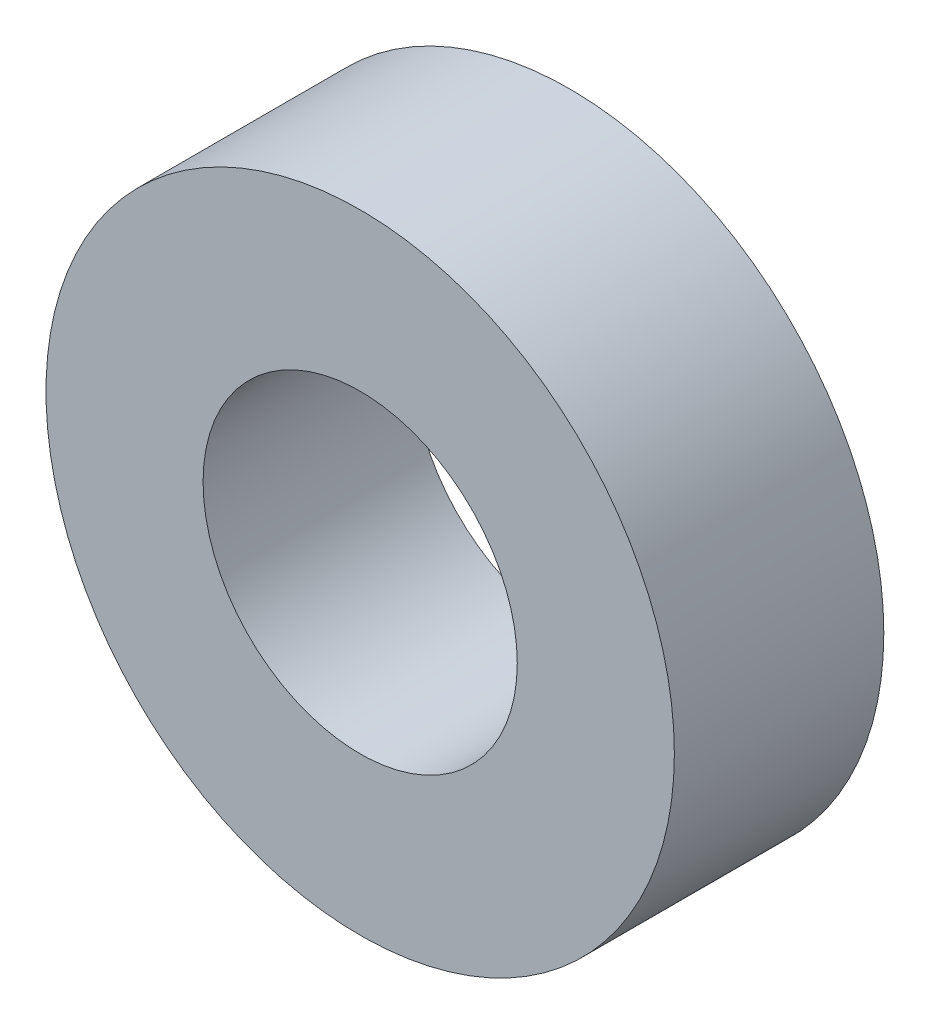
ISO-10303-21;
HEADER;
FILE_DESCRIPTION(('STEP AP214'),'2;1');
FILE_NAME('part.step','',(''),(''),'','','');
FILE_SCHEMA(('AUTOMOTIVE_DESIGN { 1 0 10303 214 1 1 1 1 }'));
ENDSEC;
DATA;
#1=APPLICATION_CONTEXT('core data for automotive mechanical design processes');
#2=APPLICATION_PROTOCOL_DEFINITION('international standard','automotive_design',2000,#1);
#3=PRODUCT_CONTEXT('',#1,'mechanical');
#4=PRODUCT('Part','Part','',(#3));
#5=PRODUCT_RELATED_PRODUCT_CATEGORY('part','',(#4));
#6=PRODUCT_DEFINITION_FORMATION('','',#4);
#7=PRODUCT_DEFINITION_CONTEXT('part definition',#1,'design');
#8=PRODUCT_DEFINITION('design','',#6,#7);
#9=PRODUCT_DEFINITION_SHAPE('','',#8);
#10=(LENGTH_UNIT() NAMED_UNIT(*) SI_UNIT(.MILLI.,.METRE.));
#11=(NAMED_UNIT(*) PLANE_ANGLE_UNIT() SI_UNIT($,.RADIAN.));
#12=(NAMED_UNIT(*) SI_UNIT($,.STERADIAN.) SOLID_ANGLE_UNIT());
#13=UNCERTAINTY_MEASURE_WITH_UNIT(LENGTH_MEASURE(1.E-05),#10,'distance_accuracy_value','');
#14=(GEOMETRIC_REPRESENTATION_CONTEXT(3) GLOBAL_UNCERTAINTY_ASSIGNED_CONTEXT((#13)) GLOBAL_UNIT_ASSIGNED_CONTEXT((#10,
#11,#12)) REPRESENTATION_CONTEXT('',''));
#15=CARTESIAN_POINT('',(0.,0.,0.));
#16=DIRECTION('',(0.,0.,1.));
#17=DIRECTION('',(1.,0.,0.));
#18=AXIS2_PLACEMENT_3D('',#15,#16,#17);
#19=CARTESIAN_POINT('',(0.,0.,4.));
#20=DIRECTION('',(0.,0.,1.));
#21=DIRECTION('',(1.,0.,0.));
#22=AXIS2_PLACEMENT_3D('',#19,#20,#21);
#23=PLANE('',#22);
#24=CARTESIAN_POINT('',(0.,0.,4.));
#25=DIRECTION('',(0.,0.,1.));
#26=DIRECTION('',(1.,0.,0.));
#27=AXIS2_PLACEMENT_3D('',#24,#25,#26);
#28=CIRCLE('',#27,6.);
#29=CARTESIAN_POINT('',(6.,0.,4.));
#30=VERTEX_POINT('',#29);
#31=EDGE_CURVE('E10',#30,#30,#28,.T.);
#32=ORIENTED_EDGE('',*,*,#31,.T.);
#33=EDGE_LOOP('',(#32));
#34=FACE_BOUND('',#33,.T.);
#35=CARTESIAN_POINT('',(0.,0.,4.));
#36=DIRECTION('',(0.,0.,1.));
#37=DIRECTION('',(1.,0.,0.));
#38=AXIS2_PLACEMENT_3D('',#35,#36,#37);
#39=CIRCLE('',#38,3.);
#40=CARTESIAN_POINT('',(3.,0.,4.));
#41=VERTEX_POINT('',#40);
#42=EDGE_CURVE('E50',#41,#41,#39,.T.);
#43=ORIENTED_EDGE('',*,*,#42,.F.);
#44=EDGE_LOOP('',(#43));
#45=FACE_BOUND('',#44,.T.);
#46=ADVANCED_FACE('F37',(#34,#45),#23,.T.);
#47=CARTESIAN_POINT('',(0.,0.,0.));
#48=DIRECTION('',(0.,0.,1.));
#49=DIRECTION('',(1.,0.,0.));
#50=AXIS2_PLACEMENT_3D('',#47,#48,#49);
#51=PLANE('',#50);
#52=CARTESIAN_POINT('',(0.,0.,0.));
#53=DIRECTION('',(0.,0.,1.));
#54=DIRECTION('',(1.,0.,0.));
#55=AXIS2_PLACEMENT_3D('',#52,#53,#54);
#56=CIRCLE('',#55,6.);
#57=CARTESIAN_POINT('',(6.,0.,0.));
#58=VERTEX_POINT('',#57);
#59=EDGE_CURVE('E41',#58,#58,#56,.T.);
#60=ORIENTED_EDGE('',*,*,#59,.F.);
#61=EDGE_LOOP('',(#60));
#62=FACE_BOUND('',#61,.T.);
#63=CARTESIAN_POINT('',(0.,0.,0.));
#64=DIRECTION('',(0.,0.,1.));
#65=DIRECTION('',(1.,0.,0.));
#66=AXIS2_PLACEMENT_3D('',#63,#64,#65);
#67=CIRCLE('',#66,3.);
#68=CARTESIAN_POINT('',(3.,0.,0.));
#69=VERTEX_POINT('',#68);
#70=EDGE_CURVE('E52',#69,#69,#67,.T.);
#71=ORIENTED_EDGE('',*,*,#70,.T.);
#72=EDGE_LOOP('',(#71));
#73=FACE_BOUND('',#72,.T.);
#74=ADVANCED_FACE('F64',(#62,#73),#51,.F.);
#75=CARTESIAN_POINT('',(0.,0.,4.));
#76=DIRECTION('',(0.,0.,-1.));
#77=DIRECTION('',(-1.,0.,0.));
#78=AXIS2_PLACEMENT_3D('',#75,#76,#77);
#79=CYLINDRICAL_SURFACE('',#78,6.);
#80=ORIENTED_EDGE('',*,*,#31,.F.);
#81=EDGE_LOOP('',(#80));
#82=FACE_BOUND('',#81,.T.);
#83=ORIENTED_EDGE('',*,*,#59,.T.);
#84=EDGE_LOOP('',(#83));
#85=FACE_BOUND('',#84,.T.);
#86=ADVANCED_FACE('F39',(#82,#85),#79,.T.);
#87=CARTESIAN_POINT('',(0.,0.,4.));
#88=DIRECTION('',(0.,0.,-1.));
#89=DIRECTION('',(-1.,0.,0.));
#90=AXIS2_PLACEMENT_3D('',#87,#88,#89);
#91=CYLINDRICAL_SURFACE('',#90,3.);
#92=ORIENTED_EDGE('',*,*,#42,.T.);
#93=EDGE_LOOP('',(#92));
#94=FACE_BOUND('',#93,.T.);
#95=ORIENTED_EDGE('',*,*,#70,.F.);
#96=EDGE_LOOP('',(#95));
#97=FACE_BOUND('',#96,.T.);
#98=ADVANCED_FACE('F60',(#94,#97),#91,.F.);
#99=CLOSED_SHELL('',(#46,#74,#86,#98));
#100=MANIFOLD_SOLID_BREP('B2',#99);
#101=ADVANCED_BREP_SHAPE_REPRESENTATION('',(#18,#100),#14);
#102=SHAPE_DEFINITION_REPRESENTATION(#9,#101);
ENDSEC;
END-ISO-10303-21;
